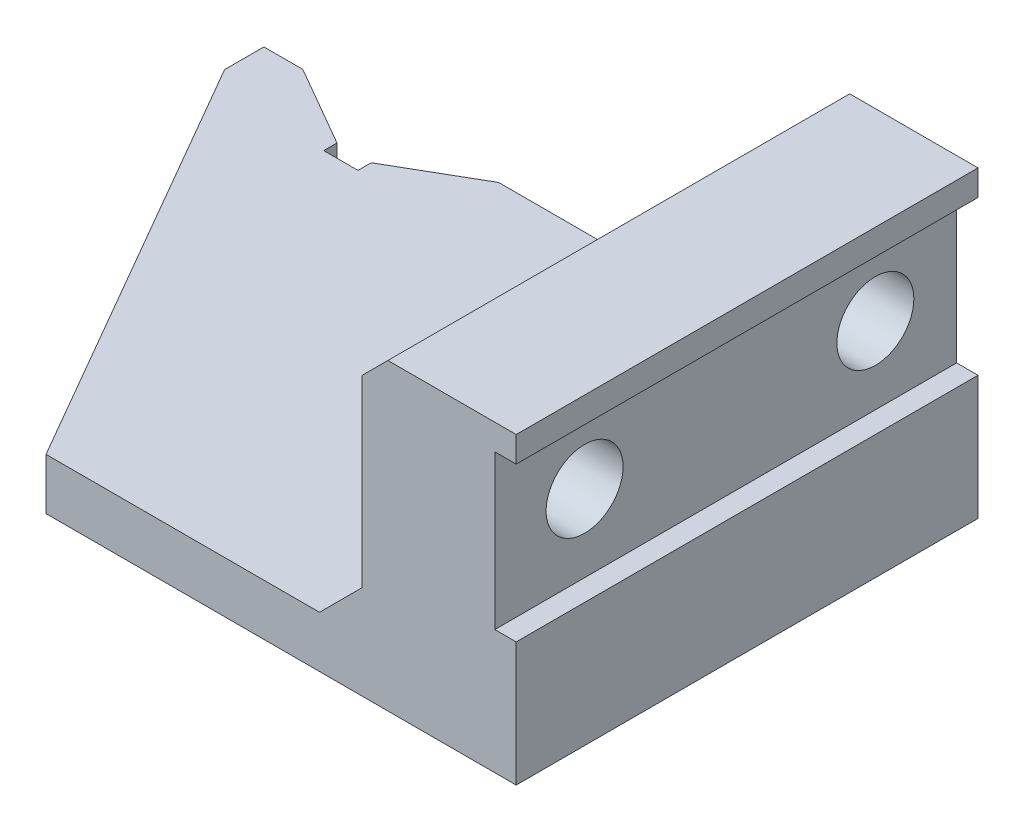
ISO-10303-21;
HEADER;
FILE_DESCRIPTION(('STEP AP214'),'2;1');
FILE_NAME('part.step','',(''),(''),'','','');
FILE_SCHEMA(('AUTOMOTIVE_DESIGN { 1 0 10303 214 1 1 1 1 }'));
ENDSEC;
DATA;
#1=APPLICATION_CONTEXT('core data for automotive mechanical design processes');
#2=APPLICATION_PROTOCOL_DEFINITION('international standard','automotive_design',2000,#1);
#3=PRODUCT_CONTEXT('',#1,'mechanical');
#4=PRODUCT('Part','Part','',(#3));
#5=PRODUCT_RELATED_PRODUCT_CATEGORY('part','',(#4));
#6=PRODUCT_DEFINITION_FORMATION('','',#4);
#7=PRODUCT_DEFINITION_CONTEXT('part definition',#1,'design');
#8=PRODUCT_DEFINITION('design','',#6,#7);
#9=PRODUCT_DEFINITION_SHAPE('','',#8);
#10=(LENGTH_UNIT() NAMED_UNIT(*) SI_UNIT(.MILLI.,.METRE.));
#11=(NAMED_UNIT(*) PLANE_ANGLE_UNIT() SI_UNIT($,.RADIAN.));
#12=(NAMED_UNIT(*) SI_UNIT($,.STERADIAN.) SOLID_ANGLE_UNIT());
#13=UNCERTAINTY_MEASURE_WITH_UNIT(LENGTH_MEASURE(1.E-05),#10,'distance_accuracy_value','');
#14=(GEOMETRIC_REPRESENTATION_CONTEXT(3) GLOBAL_UNCERTAINTY_ASSIGNED_CONTEXT((#13)) GLOBAL_UNIT_ASSIGNED_CONTEXT((#10,
#11,#12)) REPRESENTATION_CONTEXT('',''));
#15=CARTESIAN_POINT('',(0.,0.,0.));
#16=DIRECTION('',(0.,0.,1.));
#17=DIRECTION('',(1.,0.,0.));
#18=AXIS2_PLACEMENT_3D('',#15,#16,#17);
#19=CARTESIAN_POINT('',(-0.001000000000001,23.5,9.5));
#20=DIRECTION('',(1.,0.,0.));
#21=DIRECTION('',(0.,0.,-1.));
#22=AXIS2_PLACEMENT_3D('',#19,#20,#21);
#23=CYLINDRICAL_SURFACE('',#22,4.5);
#24=CARTESIAN_POINT('',(81.,23.5,9.5));
#25=DIRECTION('',(1.,0.,0.));
#26=DIRECTION('',(0.,0.,-1.));
#27=AXIS2_PLACEMENT_3D('',#24,#25,#26);
#28=CIRCLE('',#27,4.5);
#29=CARTESIAN_POINT('',(81.,23.5,5.));
#30=VERTEX_POINT('',#29);
#31=EDGE_CURVE('E194',#30,#30,#28,.T.);
#32=ORIENTED_EDGE('',*,*,#31,.T.);
#33=EDGE_LOOP('',(#32));
#34=FACE_BOUND('',#33,.T.);
#35=CARTESIAN_POINT('',(73.5,23.5,9.5));
#36=DIRECTION('',(-1.,0.,0.));
#37=DIRECTION('',(0.,0.,1.));
#38=AXIS2_PLACEMENT_3D('',#35,#36,#37);
#39=CIRCLE('',#38,4.5);
#40=CARTESIAN_POINT('',(73.5,23.5,14.));
#41=VERTEX_POINT('',#40);
#42=EDGE_CURVE('E37',#41,#41,#39,.F.);
#43=ORIENTED_EDGE('',*,*,#42,.F.);
#44=EDGE_LOOP('',(#43));
#45=FACE_BOUND('',#44,.T.);
#46=ADVANCED_FACE('F33',(#34,#45),#23,.F.);
#47=CARTESIAN_POINT('',(-0.001000000000001,23.5,43.5));
#48=DIRECTION('',(1.,0.,0.));
#49=DIRECTION('',(0.,0.,-1.));
#50=AXIS2_PLACEMENT_3D('',#47,#48,#49);
#51=CYLINDRICAL_SURFACE('',#50,4.5);
#52=CARTESIAN_POINT('',(81.,23.5,43.5));
#53=DIRECTION('',(1.,0.,0.));
#54=DIRECTION('',(0.,0.,-1.));
#55=AXIS2_PLACEMENT_3D('',#52,#53,#54);
#56=CIRCLE('',#55,4.5);
#57=CARTESIAN_POINT('',(81.,23.5,39.));
#58=VERTEX_POINT('',#57);
#59=EDGE_CURVE('E310',#58,#58,#56,.T.);
#60=ORIENTED_EDGE('',*,*,#59,.T.);
#61=EDGE_LOOP('',(#60));
#62=FACE_BOUND('',#61,.T.);
#63=CARTESIAN_POINT('',(73.5,23.5,43.5));
#64=DIRECTION('',(-1.,0.,0.));
#65=DIRECTION('',(0.,0.,1.));
#66=AXIS2_PLACEMENT_3D('',#63,#64,#65);
#67=CIRCLE('',#66,4.5);
#68=CARTESIAN_POINT('',(73.5,23.5,48.));
#69=VERTEX_POINT('',#68);
#70=EDGE_CURVE('E308',#69,#69,#67,.F.);
#71=ORIENTED_EDGE('',*,*,#70,.F.);
#72=EDGE_LOOP('',(#71));
#73=FACE_BOUND('',#72,.T.);
#74=ADVANCED_FACE('F336',(#62,#73),#51,.F.);
#75=CARTESIAN_POINT('',(0.,0.,0.));
#76=DIRECTION('',(0.,0.,1.));
#77=DIRECTION('',(1.,0.,0.));
#78=AXIS2_PLACEMENT_3D('',#75,#76,#77);
#79=PLANE('',#78);
#80=DIRECTION('',(-1.,0.,0.));
#81=VECTOR('',#80,1.);
#82=CARTESIAN_POINT('',(60.5,6.00000000000001,0.));
#83=LINE('',#82,#81);
#84=CARTESIAN_POINT('',(4.55536268481128,6.,0.));
#85=VERTEX_POINT('',#84);
#86=CARTESIAN_POINT('',(0.,6.,0.));
#87=VERTEX_POINT('',#86);
#88=EDGE_CURVE('E225',#85,#87,#83,.T.);
#89=ORIENTED_EDGE('',*,*,#88,.F.);
#90=DIRECTION('',(0.,1.,0.));
#91=VECTOR('',#90,1.);
#92=CARTESIAN_POINT('',(4.55536268481128,0.,0.));
#93=LINE('',#92,#91);
#94=CARTESIAN_POINT('',(4.55536268481128,0.,0.));
#95=VERTEX_POINT('',#94);
#96=EDGE_CURVE('E216',#95,#85,#93,.T.);
#97=ORIENTED_EDGE('',*,*,#96,.F.);
#98=DIRECTION('',(1.,0.,0.));
#99=VECTOR('',#98,1.);
#100=CARTESIAN_POINT('',(0.,0.,0.));
#101=LINE('',#100,#99);
#102=CARTESIAN_POINT('',(0.,0.,0.));
#103=VERTEX_POINT('',#102);
#104=EDGE_CURVE('E260',#103,#95,#101,.T.);
#105=ORIENTED_EDGE('',*,*,#104,.F.);
#106=DIRECTION('',(0.,-1.,0.));
#107=VECTOR('',#106,1.);
#108=CARTESIAN_POINT('',(0.,6.,0.));
#109=LINE('',#108,#107);
#110=EDGE_CURVE('E256',#87,#103,#109,.T.);
#111=ORIENTED_EDGE('',*,*,#110,.F.);
#112=EDGE_LOOP('',(#89,#97,#105,#111));
#113=FACE_BOUND('',#112,.T.);
#114=ADVANCED_FACE('F343',(#113),#79,.F.);
#115=CARTESIAN_POINT('',(60.5,6.00000000000001,54.));
#116=DIRECTION('',(0.,-1.,0.));
#117=DIRECTION('',(1.,0.,0.));
#118=AXIS2_PLACEMENT_3D('',#115,#116,#117);
#119=PLANE('',#118);
#120=DIRECTION('',(0.,0.,1.));
#121=VECTOR('',#120,1.);
#122=CARTESIAN_POINT('',(14.,6.,0.));
#123=LINE('',#122,#121);
#124=CARTESIAN_POINT('',(14.,6.,5.45286389632251));
#125=VERTEX_POINT('',#124);
#126=CARTESIAN_POINT('',(14.,6.,7.));
#127=VERTEX_POINT('',#126);
#128=EDGE_CURVE('E191',#125,#127,#123,.T.);
#129=ORIENTED_EDGE('',*,*,#128,.F.);
#130=DIRECTION('',(0.866025403784442,0.,0.499999999999995));
#131=VECTOR('',#130,1.);
#132=CARTESIAN_POINT('',(1.1388406712028,6.,-1.97252990424911));
#133=LINE('',#132,#131);
#134=EDGE_CURVE('E204',#85,#125,#133,.T.);
#135=ORIENTED_EDGE('',*,*,#134,.F.);
#136=ORIENTED_EDGE('',*,*,#88,.T.);
#137=DIRECTION('',(0.,0.,-1.));
#138=VECTOR('',#137,1.);
#139=CARTESIAN_POINT('',(0.,6.,54.));
#140=LINE('',#139,#138);
#141=CARTESIAN_POINT('',(0.,6.,4.6));
#142=VERTEX_POINT('',#141);
#143=EDGE_CURVE('E11',#142,#87,#140,.T.);
#144=ORIENTED_EDGE('',*,*,#143,.F.);
#145=DIRECTION('',(0.499999999999995,0.,0.866025403784441));
#146=VECTOR('',#145,1.);
#147=CARTESIAN_POINT('',(-1.9918584287042,6.,1.14999999999998));
#148=LINE('',#147,#146);
#149=CARTESIAN_POINT('',(28.5211032979671,6.,54.));
#150=VERTEX_POINT('',#149);
#151=EDGE_CURVE('E211',#142,#150,#148,.T.);
#152=ORIENTED_EDGE('',*,*,#151,.T.);
#153=DIRECTION('',(-1.,0.,0.));
#154=VECTOR('',#153,1.);
#155=CARTESIAN_POINT('',(60.5,6.00000000000001,54.));
#156=LINE('',#155,#154);
#157=CARTESIAN_POINT('',(60.5,6.00000000000001,54.));
#158=VERTEX_POINT('',#157);
#159=EDGE_CURVE('E228',#158,#150,#156,.T.);
#160=ORIENTED_EDGE('',*,*,#159,.F.);
#161=DIRECTION('',(0.,0.,-1.));
#162=VECTOR('',#161,1.);
#163=CARTESIAN_POINT('',(60.5,6.00000000000001,54.));
#164=LINE('',#163,#162);
#165=CARTESIAN_POINT('',(60.5,6.00000000000001,0.));
#166=VERTEX_POINT('',#165);
#167=EDGE_CURVE('E252',#158,#166,#164,.T.);
#168=ORIENTED_EDGE('',*,*,#167,.T.);
#169=CARTESIAN_POINT('',(27.4553626848113,6.,0.));
#170=VERTEX_POINT('',#169);
#171=EDGE_CURVE('E253',#166,#170,#83,.T.);
#172=ORIENTED_EDGE('',*,*,#171,.T.);
#173=DIRECTION('',(0.866025403784434,0.,-0.500000000000007));
#174=VECTOR('',#173,1.);
#175=CARTESIAN_POINT('',(6.86384067120302,6.,11.8885207775811));
#176=LINE('',#175,#174);
#177=CARTESIAN_POINT('',(18.,6.,5.45905619136144));
#178=VERTEX_POINT('',#177);
#179=EDGE_CURVE('E50',#178,#170,#176,.T.);
#180=ORIENTED_EDGE('',*,*,#179,.F.);
#181=DIRECTION('',(0.,0.,-1.));
#182=VECTOR('',#181,1.);
#183=CARTESIAN_POINT('',(18.,6.,0.));
#184=LINE('',#183,#182);
#185=CARTESIAN_POINT('',(18.,6.,7.));
#186=VERTEX_POINT('',#185);
#187=EDGE_CURVE('E173',#186,#178,#184,.T.);
#188=ORIENTED_EDGE('',*,*,#187,.F.);
#189=DIRECTION('',(1.,0.,0.));
#190=VECTOR('',#189,1.);
#191=CARTESIAN_POINT('',(0.,6.,7.));
#192=LINE('',#191,#190);
#193=EDGE_CURVE('E188',#127,#186,#192,.T.);
#194=ORIENTED_EDGE('',*,*,#193,.F.);
#195=EDGE_LOOP('',(#129,#135,#136,#144,#152,#160,#168,#172,#180,#188,#194));
#196=FACE_BOUND('',#195,.T.);
#197=ADVANCED_FACE('F35',(#196),#119,.F.);
#198=CARTESIAN_POINT('',(0.,6.,54.));
#199=DIRECTION('',(1.,0.,0.));
#200=DIRECTION('',(0.,0.,-1.));
#201=AXIS2_PLACEMENT_3D('',#198,#199,#200);
#202=PLANE('',#201);
#203=DIRECTION('',(0.,1.,0.));
#204=VECTOR('',#203,1.);
#205=CARTESIAN_POINT('',(0.,0.,4.6));
#206=LINE('',#205,#204);
#207=CARTESIAN_POINT('',(0.,0.,4.6));
#208=VERTEX_POINT('',#207);
#209=EDGE_CURVE('E220',#208,#142,#206,.T.);
#210=ORIENTED_EDGE('',*,*,#209,.T.);
#211=ORIENTED_EDGE('',*,*,#143,.T.);
#212=ORIENTED_EDGE('',*,*,#110,.T.);
#213=DIRECTION('',(0.,0.,-1.));
#214=VECTOR('',#213,1.);
#215=CARTESIAN_POINT('',(0.,0.,54.));
#216=LINE('',#215,#214);
#217=EDGE_CURVE('E42',#208,#103,#216,.T.);
#218=ORIENTED_EDGE('',*,*,#217,.F.);
#219=EDGE_LOOP('',(#210,#211,#212,#218));
#220=FACE_BOUND('',#219,.T.);
#221=ADVANCED_FACE('F414',(#220),#202,.F.);
#222=CARTESIAN_POINT('',(0.,0.,54.));
#223=DIRECTION('',(0.,1.,0.));
#224=DIRECTION('',(0.,0.,1.));
#225=AXIS2_PLACEMENT_3D('',#222,#223,#224);
#226=PLANE('',#225);
#227=ORIENTED_EDGE('',*,*,#104,.T.);
#228=DIRECTION('',(0.866025403784442,0.,0.499999999999995));
#229=VECTOR('',#228,1.);
#230=CARTESIAN_POINT('',(1.1388406712028,0.,-1.97252990424911));
#231=LINE('',#230,#229);
#232=CARTESIAN_POINT('',(14.,0.,5.45286389632251));
#233=VERTEX_POINT('',#232);
#234=EDGE_CURVE('E182',#95,#233,#231,.T.);
#235=ORIENTED_EDGE('',*,*,#234,.T.);
#236=DIRECTION('',(0.,0.,1.));
#237=VECTOR('',#236,1.);
#238=CARTESIAN_POINT('',(14.,0.,0.));
#239=LINE('',#238,#237);
#240=CARTESIAN_POINT('',(14.,0.,7.));
#241=VERTEX_POINT('',#240);
#242=EDGE_CURVE('E199',#233,#241,#239,.T.);
#243=ORIENTED_EDGE('',*,*,#242,.T.);
#244=DIRECTION('',(1.,0.,0.));
#245=VECTOR('',#244,1.);
#246=CARTESIAN_POINT('',(0.,0.,7.));
#247=LINE('',#246,#245);
#248=CARTESIAN_POINT('',(18.,0.,7.));
#249=VERTEX_POINT('',#248);
#250=EDGE_CURVE('E175',#241,#249,#247,.T.);
#251=ORIENTED_EDGE('',*,*,#250,.T.);
#252=DIRECTION('',(0.,0.,-1.));
#253=VECTOR('',#252,1.);
#254=CARTESIAN_POINT('',(18.,0.,0.));
#255=LINE('',#254,#253);
#256=CARTESIAN_POINT('',(18.,0.,5.45905619136144));
#257=VERTEX_POINT('',#256);
#258=EDGE_CURVE('E170',#249,#257,#255,.T.);
#259=ORIENTED_EDGE('',*,*,#258,.T.);
#260=DIRECTION('',(0.866025403784434,0.,-0.500000000000007));
#261=VECTOR('',#260,1.);
#262=CARTESIAN_POINT('',(6.86384067120302,0.,11.8885207775811));
#263=LINE('',#262,#261);
#264=CARTESIAN_POINT('',(27.4553626848113,0.,0.));
#265=VERTEX_POINT('',#264);
#266=EDGE_CURVE('E178',#257,#265,#263,.T.);
#267=ORIENTED_EDGE('',*,*,#266,.T.);
#268=CARTESIAN_POINT('',(83.5,0.,0.));
#269=VERTEX_POINT('',#268);
#270=EDGE_CURVE('E259',#265,#269,#101,.T.);
#271=ORIENTED_EDGE('',*,*,#270,.T.);
#272=DIRECTION('',(0.,0.,-1.));
#273=VECTOR('',#272,1.);
#274=CARTESIAN_POINT('',(83.5,0.,54.));
#275=LINE('',#274,#273);
#276=CARTESIAN_POINT('',(83.5,0.,54.));
#277=VERTEX_POINT('',#276);
#278=EDGE_CURVE('E305',#277,#269,#275,.T.);
#279=ORIENTED_EDGE('',*,*,#278,.F.);
#280=DIRECTION('',(1.,0.,0.));
#281=VECTOR('',#280,1.);
#282=CARTESIAN_POINT('',(0.,0.,54.));
#283=LINE('',#282,#281);
#284=CARTESIAN_POINT('',(28.5211032979671,0.,54.));
#285=VERTEX_POINT('',#284);
#286=EDGE_CURVE('E231',#285,#277,#283,.T.);
#287=ORIENTED_EDGE('',*,*,#286,.F.);
#288=DIRECTION('',(0.499999999999995,0.,0.866025403784441));
#289=VECTOR('',#288,1.);
#290=CARTESIAN_POINT('',(-1.99185842870419,0.,1.14999999999998));
#291=LINE('',#290,#289);
#292=EDGE_CURVE('E58',#208,#285,#291,.T.);
#293=ORIENTED_EDGE('',*,*,#292,.F.);
#294=ORIENTED_EDGE('',*,*,#217,.T.);
#295=EDGE_LOOP('',(#227,#235,#243,#251,#259,#267,#271,#279,#287,#293,#294));
#296=FACE_BOUND('',#295,.T.);
#297=ADVANCED_FACE('F185',(#296),#226,.F.);
#298=CARTESIAN_POINT('',(0.,0.,54.));
#299=DIRECTION('',(0.,0.,1.));
#300=DIRECTION('',(1.,0.,0.));
#301=AXIS2_PLACEMENT_3D('',#298,#299,#300);
#302=PLANE('',#301);
#303=ORIENTED_EDGE('',*,*,#159,.T.);
#304=DIRECTION('',(0.,1.,0.));
#305=VECTOR('',#304,1.);
#306=CARTESIAN_POINT('',(28.5211032979671,0.,54.));
#307=LINE('',#306,#305);
#308=EDGE_CURVE('E223',#285,#150,#307,.T.);
#309=ORIENTED_EDGE('',*,*,#308,.F.);
#310=ORIENTED_EDGE('',*,*,#286,.T.);
#311=DIRECTION('',(0.,1.,0.));
#312=VECTOR('',#311,1.);
#313=CARTESIAN_POINT('',(83.5,0.,54.));
#314=LINE('',#313,#312);
#315=CARTESIAN_POINT('',(83.5,14.5,54.));
#316=VERTEX_POINT('',#315);
#317=EDGE_CURVE('E234',#277,#316,#314,.T.);
#318=ORIENTED_EDGE('',*,*,#317,.T.);
#319=DIRECTION('',(-1.,0.,0.));
#320=VECTOR('',#319,1.);
#321=CARTESIAN_POINT('',(83.5,14.5,54.));
#322=LINE('',#321,#320);
#323=CARTESIAN_POINT('',(81.,14.5,54.));
#324=VERTEX_POINT('',#323);
#325=EDGE_CURVE('E236',#316,#324,#322,.T.);
#326=ORIENTED_EDGE('',*,*,#325,.T.);
#327=DIRECTION('',(0.,1.,0.));
#328=VECTOR('',#327,1.);
#329=CARTESIAN_POINT('',(81.,14.5,54.));
#330=LINE('',#329,#328);
#331=CARTESIAN_POINT('',(81.,32.5,54.));
#332=VERTEX_POINT('',#331);
#333=EDGE_CURVE('E238',#324,#332,#330,.T.);
#334=ORIENTED_EDGE('',*,*,#333,.T.);
#335=DIRECTION('',(1.,0.,0.));
#336=VECTOR('',#335,1.);
#337=CARTESIAN_POINT('',(81.,32.5,54.));
#338=LINE('',#337,#336);
#339=CARTESIAN_POINT('',(83.5,32.5,54.));
#340=VERTEX_POINT('',#339);
#341=EDGE_CURVE('E240',#332,#340,#338,.T.);
#342=ORIENTED_EDGE('',*,*,#341,.T.);
#343=DIRECTION('',(0.,1.,0.));
#344=VECTOR('',#343,1.);
#345=CARTESIAN_POINT('',(83.5,32.5,54.));
#346=LINE('',#345,#344);
#347=CARTESIAN_POINT('',(83.5,35.5,54.));
#348=VERTEX_POINT('',#347);
#349=EDGE_CURVE('E242',#340,#348,#346,.T.);
#350=ORIENTED_EDGE('',*,*,#349,.T.);
#351=DIRECTION('',(-1.,0.,0.));
#352=VECTOR('',#351,1.);
#353=CARTESIAN_POINT('',(83.5,35.5,54.));
#354=LINE('',#353,#352);
#355=CARTESIAN_POINT('',(68.5,35.5,54.));
#356=VERTEX_POINT('',#355);
#357=EDGE_CURVE('E244',#348,#356,#354,.T.);
#358=ORIENTED_EDGE('',*,*,#357,.T.);
#359=DIRECTION('',(-0.707106781186547,-0.707106781186548,0.));
#360=VECTOR('',#359,1.);
#361=CARTESIAN_POINT('',(68.5,35.5,54.));
#362=LINE('',#361,#360);
#363=CARTESIAN_POINT('',(65.5,32.5,54.));
#364=VERTEX_POINT('',#363);
#365=EDGE_CURVE('E246',#356,#364,#362,.T.);
#366=ORIENTED_EDGE('',*,*,#365,.T.);
#367=DIRECTION('',(0.,-1.,0.));
#368=VECTOR('',#367,1.);
#369=CARTESIAN_POINT('',(65.5,32.5,54.));
#370=LINE('',#369,#368);
#371=CARTESIAN_POINT('',(65.5,11.,54.));
#372=VERTEX_POINT('',#371);
#373=EDGE_CURVE('E248',#364,#372,#370,.T.);
#374=ORIENTED_EDGE('',*,*,#373,.T.);
#375=DIRECTION('',(-0.707106781186544,-0.707106781186551,0.));
#376=VECTOR('',#375,1.);
#377=CARTESIAN_POINT('',(65.5,11.,54.));
#378=LINE('',#377,#376);
#379=EDGE_CURVE('E250',#372,#158,#378,.T.);
#380=ORIENTED_EDGE('',*,*,#379,.T.);
#381=EDGE_LOOP('',(#303,#309,#310,#318,#326,#334,#342,#350,#358,#366,#374,#380));
#382=FACE_BOUND('',#381,.T.);
#383=ADVANCED_FACE('F370',(#382),#302,.T.);
#384=CARTESIAN_POINT('',(83.5,0.,54.));
#385=DIRECTION('',(-1.,0.,0.));
#386=DIRECTION('',(0.,0.,1.));
#387=AXIS2_PLACEMENT_3D('',#384,#385,#386);
#388=PLANE('',#387);
#389=DIRECTION('',(0.,1.,0.));
#390=VECTOR('',#389,1.);
#391=CARTESIAN_POINT('',(83.5,0.,0.));
#392=LINE('',#391,#390);
#393=CARTESIAN_POINT('',(83.5,14.5,0.));
#394=VERTEX_POINT('',#393);
#395=EDGE_CURVE('E262',#269,#394,#392,.T.);
#396=ORIENTED_EDGE('',*,*,#395,.T.);
#397=DIRECTION('',(0.,0.,-1.));
#398=VECTOR('',#397,1.);
#399=CARTESIAN_POINT('',(83.5,14.5,54.));
#400=LINE('',#399,#398);
#401=EDGE_CURVE('E302',#316,#394,#400,.T.);
#402=ORIENTED_EDGE('',*,*,#401,.F.);
#403=ORIENTED_EDGE('',*,*,#317,.F.);
#404=ORIENTED_EDGE('',*,*,#278,.T.);
#405=EDGE_LOOP('',(#396,#402,#403,#404));
#406=FACE_BOUND('',#405,.T.);
#407=ADVANCED_FACE('F373',(#406),#388,.F.);
#408=CARTESIAN_POINT('',(83.5,14.5,54.));
#409=DIRECTION('',(0.,-1.,0.));
#410=DIRECTION('',(1.,0.,0.));
#411=AXIS2_PLACEMENT_3D('',#408,#409,#410);
#412=PLANE('',#411);
#413=DIRECTION('',(-1.,0.,0.));
#414=VECTOR('',#413,1.);
#415=CARTESIAN_POINT('',(83.5,14.5,0.));
#416=LINE('',#415,#414);
#417=CARTESIAN_POINT('',(81.,14.5,0.));
#418=VERTEX_POINT('',#417);
#419=EDGE_CURVE('E264',#394,#418,#416,.T.);
#420=ORIENTED_EDGE('',*,*,#419,.T.);
#421=DIRECTION('',(0.,0.,-1.));
#422=VECTOR('',#421,1.);
#423=CARTESIAN_POINT('',(81.,14.5,54.));
#424=LINE('',#423,#422);
#425=EDGE_CURVE('E299',#324,#418,#424,.T.);
#426=ORIENTED_EDGE('',*,*,#425,.F.);
#427=ORIENTED_EDGE('',*,*,#325,.F.);
#428=ORIENTED_EDGE('',*,*,#401,.T.);
#429=EDGE_LOOP('',(#420,#426,#427,#428));
#430=FACE_BOUND('',#429,.T.);
#431=ADVANCED_FACE('F405',(#430),#412,.F.);
#432=CARTESIAN_POINT('',(81.,14.5,54.));
#433=DIRECTION('',(-1.,0.,0.));
#434=DIRECTION('',(0.,0.,1.));
#435=AXIS2_PLACEMENT_3D('',#432,#433,#434);
#436=PLANE('',#435);
#437=ORIENTED_EDGE('',*,*,#59,.F.);
#438=EDGE_LOOP('',(#437));
#439=FACE_BOUND('',#438,.T.);
#440=ORIENTED_EDGE('',*,*,#31,.F.);
#441=EDGE_LOOP('',(#440));
#442=FACE_BOUND('',#441,.T.);
#443=DIRECTION('',(0.,1.,0.));
#444=VECTOR('',#443,1.);
#445=CARTESIAN_POINT('',(81.,14.5,0.));
#446=LINE('',#445,#444);
#447=CARTESIAN_POINT('',(81.,32.5,0.));
#448=VERTEX_POINT('',#447);
#449=EDGE_CURVE('E266',#418,#448,#446,.T.);
#450=ORIENTED_EDGE('',*,*,#449,.T.);
#451=DIRECTION('',(0.,0.,-1.));
#452=VECTOR('',#451,1.);
#453=CARTESIAN_POINT('',(81.,32.5,54.));
#454=LINE('',#453,#452);
#455=EDGE_CURVE('E296',#332,#448,#454,.T.);
#456=ORIENTED_EDGE('',*,*,#455,.F.);
#457=ORIENTED_EDGE('',*,*,#333,.F.);
#458=ORIENTED_EDGE('',*,*,#425,.T.);
#459=EDGE_LOOP('',(#450,#456,#457,#458));
#460=FACE_BOUND('',#459,.T.);
#461=ADVANCED_FACE('F401',(#439,#442,#460),#436,.F.);
#462=CARTESIAN_POINT('',(81.,32.5,54.));
#463=DIRECTION('',(0.,1.,0.));
#464=DIRECTION('',(-1.,0.,0.));
#465=AXIS2_PLACEMENT_3D('',#462,#463,#464);
#466=PLANE('',#465);
#467=DIRECTION('',(1.,0.,0.));
#468=VECTOR('',#467,1.);
#469=CARTESIAN_POINT('',(81.,32.5,0.));
#470=LINE('',#469,#468);
#471=CARTESIAN_POINT('',(83.5,32.5,0.));
#472=VERTEX_POINT('',#471);
#473=EDGE_CURVE('E268',#448,#472,#470,.T.);
#474=ORIENTED_EDGE('',*,*,#473,.T.);
#475=DIRECTION('',(0.,0.,-1.));
#476=VECTOR('',#475,1.);
#477=CARTESIAN_POINT('',(83.5,32.5,54.));
#478=LINE('',#477,#476);
#479=EDGE_CURVE('E293',#340,#472,#478,.T.);
#480=ORIENTED_EDGE('',*,*,#479,.F.);
#481=ORIENTED_EDGE('',*,*,#341,.F.);
#482=ORIENTED_EDGE('',*,*,#455,.T.);
#483=EDGE_LOOP('',(#474,#480,#481,#482));
#484=FACE_BOUND('',#483,.T.);
#485=ADVANCED_FACE('F397',(#484),#466,.F.);
#486=CARTESIAN_POINT('',(83.5,32.5,54.));
#487=DIRECTION('',(-1.,0.,0.));
#488=DIRECTION('',(0.,0.,1.));
#489=AXIS2_PLACEMENT_3D('',#486,#487,#488);
#490=PLANE('',#489);
#491=DIRECTION('',(0.,1.,0.));
#492=VECTOR('',#491,1.);
#493=CARTESIAN_POINT('',(83.5,32.5,0.));
#494=LINE('',#493,#492);
#495=CARTESIAN_POINT('',(83.5,35.5,0.));
#496=VERTEX_POINT('',#495);
#497=EDGE_CURVE('E270',#472,#496,#494,.T.);
#498=ORIENTED_EDGE('',*,*,#497,.T.);
#499=DIRECTION('',(0.,0.,-1.));
#500=VECTOR('',#499,1.);
#501=CARTESIAN_POINT('',(83.5,35.5,54.));
#502=LINE('',#501,#500);
#503=EDGE_CURVE('E290',#348,#496,#502,.T.);
#504=ORIENTED_EDGE('',*,*,#503,.F.);
#505=ORIENTED_EDGE('',*,*,#349,.F.);
#506=ORIENTED_EDGE('',*,*,#479,.T.);
#507=EDGE_LOOP('',(#498,#504,#505,#506));
#508=FACE_BOUND('',#507,.T.);
#509=ADVANCED_FACE('F393',(#508),#490,.F.);
#510=CARTESIAN_POINT('',(83.5,35.5,54.));
#511=DIRECTION('',(0.,-1.,0.));
#512=DIRECTION('',(0.,0.,-1.));
#513=AXIS2_PLACEMENT_3D('',#510,#511,#512);
#514=PLANE('',#513);
#515=DIRECTION('',(-1.,0.,0.));
#516=VECTOR('',#515,1.);
#517=CARTESIAN_POINT('',(83.5,35.5,0.));
#518=LINE('',#517,#516);
#519=CARTESIAN_POINT('',(68.5,35.5,0.));
#520=VERTEX_POINT('',#519);
#521=EDGE_CURVE('E272',#496,#520,#518,.T.);
#522=ORIENTED_EDGE('',*,*,#521,.T.);
#523=DIRECTION('',(0.,0.,-1.));
#524=VECTOR('',#523,1.);
#525=CARTESIAN_POINT('',(68.5,35.5,54.));
#526=LINE('',#525,#524);
#527=EDGE_CURVE('E287',#356,#520,#526,.T.);
#528=ORIENTED_EDGE('',*,*,#527,.F.);
#529=ORIENTED_EDGE('',*,*,#357,.F.);
#530=ORIENTED_EDGE('',*,*,#503,.T.);
#531=EDGE_LOOP('',(#522,#528,#529,#530));
#532=FACE_BOUND('',#531,.T.);
#533=ADVANCED_FACE('F389',(#532),#514,.F.);
#534=CARTESIAN_POINT('',(68.5,35.5,54.));
#535=DIRECTION('',(0.707106781186548,-0.707106781186547,0.));
#536=DIRECTION('',(0.707106781186547,0.707106781186548,0.));
#537=AXIS2_PLACEMENT_3D('',#534,#535,#536);
#538=PLANE('',#537);
#539=DIRECTION('',(-0.707106781186547,-0.707106781186548,0.));
#540=VECTOR('',#539,1.);
#541=CARTESIAN_POINT('',(68.5,35.5,0.));
#542=LINE('',#541,#540);
#543=CARTESIAN_POINT('',(65.5,32.5,0.));
#544=VERTEX_POINT('',#543);
#545=EDGE_CURVE('E274',#520,#544,#542,.T.);
#546=ORIENTED_EDGE('',*,*,#545,.T.);
#547=DIRECTION('',(0.,0.,-1.));
#548=VECTOR('',#547,1.);
#549=CARTESIAN_POINT('',(65.5,32.5,54.));
#550=LINE('',#549,#548);
#551=EDGE_CURVE('E284',#364,#544,#550,.T.);
#552=ORIENTED_EDGE('',*,*,#551,.F.);
#553=ORIENTED_EDGE('',*,*,#365,.F.);
#554=ORIENTED_EDGE('',*,*,#527,.T.);
#555=EDGE_LOOP('',(#546,#552,#553,#554));
#556=FACE_BOUND('',#555,.T.);
#557=ADVANCED_FACE('F385',(#556),#538,.F.);
#558=CARTESIAN_POINT('',(65.5,32.5,54.));
#559=DIRECTION('',(1.,0.,0.));
#560=DIRECTION('',(0.,0.,-1.));
#561=AXIS2_PLACEMENT_3D('',#558,#559,#560);
#562=PLANE('',#561);
#563=CARTESIAN_POINT('',(65.5,23.5,9.5));
#564=DIRECTION('',(-1.,0.,0.));
#565=DIRECTION('',(0.,0.,1.));
#566=AXIS2_PLACEMENT_3D('',#563,#564,#565);
#567=CIRCLE('',#566,7.5);
#568=CARTESIAN_POINT('',(65.5,23.5,17.));
#569=VERTEX_POINT('',#568);
#570=EDGE_CURVE('E323',#569,#569,#567,.T.);
#571=ORIENTED_EDGE('',*,*,#570,.F.);
#572=EDGE_LOOP('',(#571));
#573=FACE_BOUND('',#572,.T.);
#574=CARTESIAN_POINT('',(65.5,23.5,43.5));
#575=DIRECTION('',(-1.,0.,0.));
#576=DIRECTION('',(0.,0.,1.));
#577=AXIS2_PLACEMENT_3D('',#574,#575,#576);
#578=CIRCLE('',#577,7.5);
#579=CARTESIAN_POINT('',(65.5,23.5,51.));
#580=VERTEX_POINT('',#579);
#581=EDGE_CURVE('E316',#580,#580,#578,.T.);
#582=ORIENTED_EDGE('',*,*,#581,.F.);
#583=EDGE_LOOP('',(#582));
#584=FACE_BOUND('',#583,.T.);
#585=DIRECTION('',(0.,-1.,0.));
#586=VECTOR('',#585,1.);
#587=CARTESIAN_POINT('',(65.5,32.5,0.));
#588=LINE('',#587,#586);
#589=CARTESIAN_POINT('',(65.5,11.,0.));
#590=VERTEX_POINT('',#589);
#591=EDGE_CURVE('E276',#544,#590,#588,.T.);
#592=ORIENTED_EDGE('',*,*,#591,.T.);
#593=DIRECTION('',(0.,0.,-1.));
#594=VECTOR('',#593,1.);
#595=CARTESIAN_POINT('',(65.5,11.,54.));
#596=LINE('',#595,#594);
#597=EDGE_CURVE('E281',#372,#590,#596,.T.);
#598=ORIENTED_EDGE('',*,*,#597,.F.);
#599=ORIENTED_EDGE('',*,*,#373,.F.);
#600=ORIENTED_EDGE('',*,*,#551,.T.);
#601=EDGE_LOOP('',(#592,#598,#599,#600));
#602=FACE_BOUND('',#601,.T.);
#603=ADVANCED_FACE('F381',(#573,#584,#602),#562,.F.);
#604=CARTESIAN_POINT('',(65.5,11.,54.));
#605=DIRECTION('',(0.707106781186551,-0.707106781186544,0.));
#606=DIRECTION('',(0.707106781186544,0.707106781186551,0.));
#607=AXIS2_PLACEMENT_3D('',#604,#605,#606);
#608=PLANE('',#607);
#609=DIRECTION('',(-0.707106781186544,-0.707106781186551,0.));
#610=VECTOR('',#609,1.);
#611=CARTESIAN_POINT('',(65.5,11.,0.));
#612=LINE('',#611,#610);
#613=EDGE_CURVE('E232',#590,#166,#612,.T.);
#614=ORIENTED_EDGE('',*,*,#613,.T.);
#615=ORIENTED_EDGE('',*,*,#167,.F.);
#616=ORIENTED_EDGE('',*,*,#379,.F.);
#617=ORIENTED_EDGE('',*,*,#597,.T.);
#618=EDGE_LOOP('',(#614,#615,#616,#617));
#619=FACE_BOUND('',#618,.T.);
#620=ADVANCED_FACE('F377',(#619),#608,.F.);
#621=ORIENTED_EDGE('',*,*,#270,.F.);
#622=DIRECTION('',(0.,1.,0.));
#623=VECTOR('',#622,1.);
#624=CARTESIAN_POINT('',(27.4553626848113,0.,0.));
#625=LINE('',#624,#623);
#626=EDGE_CURVE('E174',#265,#170,#625,.T.);
#627=ORIENTED_EDGE('',*,*,#626,.T.);
#628=ORIENTED_EDGE('',*,*,#171,.F.);
#629=ORIENTED_EDGE('',*,*,#613,.F.);
#630=ORIENTED_EDGE('',*,*,#591,.F.);
#631=ORIENTED_EDGE('',*,*,#545,.F.);
#632=ORIENTED_EDGE('',*,*,#521,.F.);
#633=ORIENTED_EDGE('',*,*,#497,.F.);
#634=ORIENTED_EDGE('',*,*,#473,.F.);
#635=ORIENTED_EDGE('',*,*,#449,.F.);
#636=ORIENTED_EDGE('',*,*,#419,.F.);
#637=ORIENTED_EDGE('',*,*,#395,.F.);
#638=EDGE_LOOP('',(#621,#627,#628,#629,#630,#631,#632,#633,#634,#635,#636,#637));
#639=FACE_BOUND('',#638,.T.);
#640=ADVANCED_FACE('F369',(#639),#79,.F.);
#641=CARTESIAN_POINT('',(-1.99185842870419,0.,1.14999999999998));
#642=DIRECTION('',(-0.866025403784442,0.,0.499999999999995));
#643=DIRECTION('',(0.499999999999995,0.,0.866025403784442));
#644=AXIS2_PLACEMENT_3D('',#641,#642,#643);
#645=PLANE('',#644);
#646=ORIENTED_EDGE('',*,*,#151,.F.);
#647=ORIENTED_EDGE('',*,*,#209,.F.);
#648=ORIENTED_EDGE('',*,*,#292,.T.);
#649=ORIENTED_EDGE('',*,*,#308,.T.);
#650=EDGE_LOOP('',(#646,#647,#648,#649));
#651=FACE_BOUND('',#650,.T.);
#652=ADVANCED_FACE('F366',(#651),#645,.T.);
#653=CARTESIAN_POINT('',(18.,0.,0.));
#654=DIRECTION('',(1.,0.,0.));
#655=DIRECTION('',(0.,1.,0.));
#656=AXIS2_PLACEMENT_3D('',#653,#654,#655);
#657=PLANE('',#656);
#658=ORIENTED_EDGE('',*,*,#187,.T.);
#659=DIRECTION('',(0.,1.,0.));
#660=VECTOR('',#659,1.);
#661=CARTESIAN_POINT('',(18.,0.,5.45905619136144));
#662=LINE('',#661,#660);
#663=EDGE_CURVE('E166',#257,#178,#662,.T.);
#664=ORIENTED_EDGE('',*,*,#663,.F.);
#665=ORIENTED_EDGE('',*,*,#258,.F.);
#666=DIRECTION('',(0.,1.,0.));
#667=VECTOR('',#666,1.);
#668=CARTESIAN_POINT('',(18.,0.,7.));
#669=LINE('',#668,#667);
#670=EDGE_CURVE('E209',#249,#186,#669,.T.);
#671=ORIENTED_EDGE('',*,*,#670,.T.);
#672=EDGE_LOOP('',(#658,#664,#665,#671));
#673=FACE_BOUND('',#672,.T.);
#674=ADVANCED_FACE('F168',(#673),#657,.F.);
#675=CARTESIAN_POINT('',(0.,0.,7.));
#676=DIRECTION('',(0.,0.,1.));
#677=DIRECTION('',(1.,0.,0.));
#678=AXIS2_PLACEMENT_3D('',#675,#676,#677);
#679=PLANE('',#678);
#680=ORIENTED_EDGE('',*,*,#193,.T.);
#681=ORIENTED_EDGE('',*,*,#670,.F.);
#682=ORIENTED_EDGE('',*,*,#250,.F.);
#683=DIRECTION('',(0.,1.,0.));
#684=VECTOR('',#683,1.);
#685=CARTESIAN_POINT('',(14.,0.,7.));
#686=LINE('',#685,#684);
#687=EDGE_CURVE('E212',#241,#127,#686,.T.);
#688=ORIENTED_EDGE('',*,*,#687,.T.);
#689=EDGE_LOOP('',(#680,#681,#682,#688));
#690=FACE_BOUND('',#689,.T.);
#691=ADVANCED_FACE('F349',(#690),#679,.F.);
#692=CARTESIAN_POINT('',(14.,0.,0.));
#693=DIRECTION('',(-1.,0.,0.));
#694=DIRECTION('',(0.,-1.,0.));
#695=AXIS2_PLACEMENT_3D('',#692,#693,#694);
#696=PLANE('',#695);
#697=ORIENTED_EDGE('',*,*,#128,.T.);
#698=ORIENTED_EDGE('',*,*,#687,.F.);
#699=ORIENTED_EDGE('',*,*,#242,.F.);
#700=DIRECTION('',(0.,1.,0.));
#701=VECTOR('',#700,1.);
#702=CARTESIAN_POINT('',(14.,0.,5.45286389632251));
#703=LINE('',#702,#701);
#704=EDGE_CURVE('E214',#233,#125,#703,.T.);
#705=ORIENTED_EDGE('',*,*,#704,.T.);
#706=EDGE_LOOP('',(#697,#698,#699,#705));
#707=FACE_BOUND('',#706,.T.);
#708=ADVANCED_FACE('F352',(#707),#696,.F.);
#709=CARTESIAN_POINT('',(1.1388406712028,0.,-1.97252990424911));
#710=DIRECTION('',(-0.499999999999995,0.,0.866025403784442));
#711=DIRECTION('',(0.866025403784442,0.,0.499999999999995));
#712=AXIS2_PLACEMENT_3D('',#709,#710,#711);
#713=PLANE('',#712);
#714=ORIENTED_EDGE('',*,*,#134,.T.);
#715=ORIENTED_EDGE('',*,*,#704,.F.);
#716=ORIENTED_EDGE('',*,*,#234,.F.);
#717=ORIENTED_EDGE('',*,*,#96,.T.);
#718=EDGE_LOOP('',(#714,#715,#716,#717));
#719=FACE_BOUND('',#718,.T.);
#720=ADVANCED_FACE('F356',(#719),#713,.F.);
#721=CARTESIAN_POINT('',(6.86384067120302,0.,11.8885207775811));
#722=DIRECTION('',(0.500000000000007,0.,0.866025403784434));
#723=DIRECTION('',(0.866025403784434,0.,-0.500000000000007));
#724=AXIS2_PLACEMENT_3D('',#721,#722,#723);
#725=PLANE('',#724);
#726=ORIENTED_EDGE('',*,*,#179,.T.);
#727=ORIENTED_EDGE('',*,*,#626,.F.);
#728=ORIENTED_EDGE('',*,*,#266,.F.);
#729=ORIENTED_EDGE('',*,*,#663,.T.);
#730=EDGE_LOOP('',(#726,#727,#728,#729));
#731=FACE_BOUND('',#730,.T.);
#732=ADVANCED_FACE('F179',(#731),#725,.F.);
#733=CARTESIAN_POINT('',(73.5,23.5,43.5));
#734=DIRECTION('',(-1.,0.,0.));
#735=DIRECTION('',(0.,0.,1.));
#736=AXIS2_PLACEMENT_3D('',#733,#734,#735);
#737=PLANE('',#736);
#738=CARTESIAN_POINT('',(73.5,23.5,43.5));
#739=DIRECTION('',(-1.,0.,0.));
#740=DIRECTION('',(0.,0.,1.));
#741=AXIS2_PLACEMENT_3D('',#738,#739,#740);
#742=CIRCLE('',#741,7.5);
#743=CARTESIAN_POINT('',(73.5,23.5,51.));
#744=VERTEX_POINT('',#743);
#745=EDGE_CURVE('E311',#744,#744,#742,.T.);
#746=ORIENTED_EDGE('',*,*,#745,.T.);
#747=EDGE_LOOP('',(#746));
#748=FACE_BOUND('',#747,.T.);
#749=ORIENTED_EDGE('',*,*,#70,.T.);
#750=EDGE_LOOP('',(#749));
#751=FACE_BOUND('',#750,.T.);
#752=ADVANCED_FACE('F363',(#748,#751),#737,.T.);
#753=CARTESIAN_POINT('',(73.5,23.5,43.5));
#754=DIRECTION('',(-1.,0.,0.));
#755=DIRECTION('',(0.,0.,1.));
#756=AXIS2_PLACEMENT_3D('',#753,#754,#755);
#757=CYLINDRICAL_SURFACE('',#756,7.5);
#758=ORIENTED_EDGE('',*,*,#745,.F.);
#759=EDGE_LOOP('',(#758));
#760=FACE_BOUND('',#759,.T.);
#761=ORIENTED_EDGE('',*,*,#581,.T.);
#762=EDGE_LOOP('',(#761));
#763=FACE_BOUND('',#762,.T.);
#764=ADVANCED_FACE('F539',(#760,#763),#757,.F.);
#765=CARTESIAN_POINT('',(73.5,23.5,9.5));
#766=DIRECTION('',(-1.,0.,0.));
#767=DIRECTION('',(0.,0.,1.));
#768=AXIS2_PLACEMENT_3D('',#765,#766,#767);
#769=PLANE('',#768);
#770=CARTESIAN_POINT('',(73.5,23.5,9.5));
#771=DIRECTION('',(-1.,0.,0.));
#772=DIRECTION('',(0.,0.,1.));
#773=AXIS2_PLACEMENT_3D('',#770,#771,#772);
#774=CIRCLE('',#773,7.5);
#775=CARTESIAN_POINT('',(73.5,23.5,17.));
#776=VERTEX_POINT('',#775);
#777=EDGE_CURVE('E326',#776,#776,#774,.T.);
#778=ORIENTED_EDGE('',*,*,#777,.T.);
#779=EDGE_LOOP('',(#778));
#780=FACE_BOUND('',#779,.T.);
#781=ORIENTED_EDGE('',*,*,#42,.T.);
#782=EDGE_LOOP('',(#781));
#783=FACE_BOUND('',#782,.T.);
#784=ADVANCED_FACE('F333',(#780,#783),#769,.T.);
#785=CARTESIAN_POINT('',(73.5,23.5,9.5));
#786=DIRECTION('',(-1.,0.,0.));
#787=DIRECTION('',(0.,0.,1.));
#788=AXIS2_PLACEMENT_3D('',#785,#786,#787);
#789=CYLINDRICAL_SURFACE('',#788,7.5);
#790=ORIENTED_EDGE('',*,*,#777,.F.);
#791=EDGE_LOOP('',(#790));
#792=FACE_BOUND('',#791,.T.);
#793=ORIENTED_EDGE('',*,*,#570,.T.);
#794=EDGE_LOOP('',(#793));
#795=FACE_BOUND('',#794,.T.);
#796=ADVANCED_FACE('F556',(#792,#795),#789,.F.);
#797=CLOSED_SHELL('',(#46,#74,#114,#197,#221,#297,#383,#407,#431,#461,#485,#509,#533,#557,#603,
#620,#640,#652,#674,#691,#708,#720,#732,#752,#764,#784,#796));
#798=MANIFOLD_SOLID_BREP('B2',#797);
#799=ADVANCED_BREP_SHAPE_REPRESENTATION('',(#18,#798),#14);
#800=SHAPE_DEFINITION_REPRESENTATION(#9,#799);
ENDSEC;
END-ISO-10303-21;
